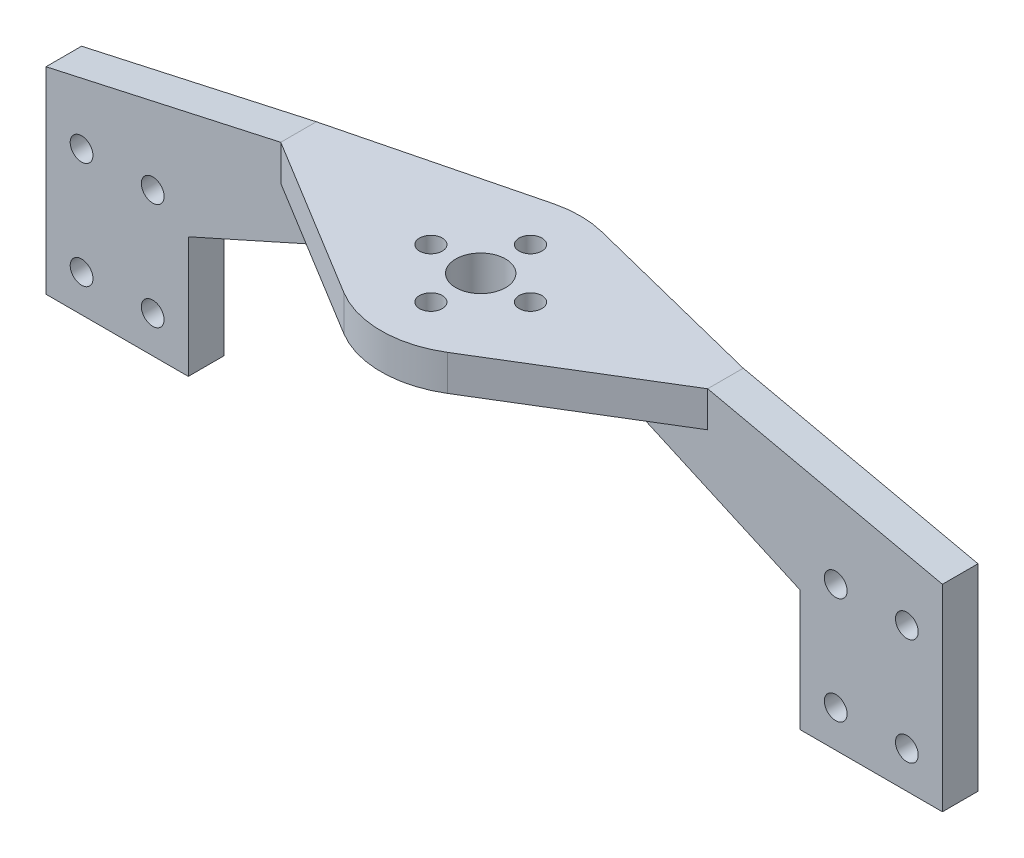
ISO-10303-21;
HEADER;
FILE_DESCRIPTION(('STEP AP214'),'2;1');
FILE_NAME('part.step','',(''),(''),'','','');
FILE_SCHEMA(('AUTOMOTIVE_DESIGN { 1 0 10303 214 1 1 1 1 }'));
ENDSEC;
DATA;
#1=APPLICATION_CONTEXT('core data for automotive mechanical design processes');
#2=APPLICATION_PROTOCOL_DEFINITION('international standard','automotive_design',2000,#1);
#3=PRODUCT_CONTEXT('',#1,'mechanical');
#4=PRODUCT('Part','Part','',(#3));
#5=PRODUCT_RELATED_PRODUCT_CATEGORY('part','',(#4));
#6=PRODUCT_DEFINITION_FORMATION('','',#4);
#7=PRODUCT_DEFINITION_CONTEXT('part definition',#1,'design');
#8=PRODUCT_DEFINITION('design','',#6,#7);
#9=PRODUCT_DEFINITION_SHAPE('','',#8);
#10=(LENGTH_UNIT() NAMED_UNIT(*) SI_UNIT(.MILLI.,.METRE.));
#11=(NAMED_UNIT(*) PLANE_ANGLE_UNIT() SI_UNIT($,.RADIAN.));
#12=(NAMED_UNIT(*) SI_UNIT($,.STERADIAN.) SOLID_ANGLE_UNIT());
#13=UNCERTAINTY_MEASURE_WITH_UNIT(LENGTH_MEASURE(1.E-05),#10,'distance_accuracy_value','');
#14=(GEOMETRIC_REPRESENTATION_CONTEXT(3) GLOBAL_UNCERTAINTY_ASSIGNED_CONTEXT((#13)) GLOBAL_UNIT_ASSIGNED_CONTEXT((#10,
#11,#12)) REPRESENTATION_CONTEXT('',''));
#15=CARTESIAN_POINT('',(0.,0.,0.));
#16=DIRECTION('',(0.,0.,1.));
#17=DIRECTION('',(1.,0.,0.));
#18=AXIS2_PLACEMENT_3D('',#15,#16,#17);
#19=CARTESIAN_POINT('',(0.,5.,-17.0232575033399));
#20=DIRECTION('',(0.,1.,0.));
#21=DIRECTION('',(0.,0.,1.));
#22=AXIS2_PLACEMENT_3D('',#19,#20,#21);
#23=PLANE('',#22);
#24=DIRECTION('',(0.,0.,-1.));
#25=VECTOR('',#24,1.);
#26=CARTESIAN_POINT('',(30.,5.,-3.02325750333987));
#27=LINE('',#26,#25);
#28=CARTESIAN_POINT('',(30.,5.,-18.9232575033399));
#29=VERTEX_POINT('',#28);
#30=CARTESIAN_POINT('',(30.,5.,-23.9232575033399));
#31=VERTEX_POINT('',#30);
#32=EDGE_CURVE('E175',#29,#31,#27,.T.);
#33=ORIENTED_EDGE('',*,*,#32,.T.);
#34=DIRECTION('',(-0.969877055784616,0.,-0.243594943836205));
#35=VECTOR('',#34,1.);
#36=CARTESIAN_POINT('',(30.,5.,-23.9232575033399));
#37=LINE('',#36,#35);
#38=CARTESIAN_POINT('',(3.41032921370687,5.,-30.6015362843245));
#39=VERTEX_POINT('',#38);
#40=EDGE_CURVE('E231',#31,#39,#37,.T.);
#41=ORIENTED_EDGE('',*,*,#40,.T.);
#42=CARTESIAN_POINT('',(0.,5.,-17.0232575033399));
#43=DIRECTION('',(0.,1.,0.));
#44=DIRECTION('',(0.,0.,1.));
#45=AXIS2_PLACEMENT_3D('',#42,#43,#44);
#46=CIRCLE('',#45,14.);
#47=CARTESIAN_POINT('',(-3.41032921370687,5.,-30.6015362843245));
#48=VERTEX_POINT('',#47);
#49=EDGE_CURVE('E234',#39,#48,#46,.T.);
#50=ORIENTED_EDGE('',*,*,#49,.T.);
#51=DIRECTION('',(-0.969877055784616,0.,0.243594943836205));
#52=VECTOR('',#51,1.);
#53=CARTESIAN_POINT('',(-30.,5.,-23.9232575033399));
#54=LINE('',#53,#52);
#55=CARTESIAN_POINT('',(-30.,5.,-23.9232575033399));
#56=VERTEX_POINT('',#55);
#57=EDGE_CURVE('E237',#48,#56,#54,.T.);
#58=ORIENTED_EDGE('',*,*,#57,.T.);
#59=DIRECTION('',(0.,0.,-1.));
#60=VECTOR('',#59,1.);
#61=CARTESIAN_POINT('',(-30.,5.,-3.02325750333987));
#62=LINE('',#61,#60);
#63=CARTESIAN_POINT('',(-30.,5.,-18.9232575033399));
#64=VERTEX_POINT('',#63);
#65=EDGE_CURVE('E432',#64,#56,#62,.T.);
#66=ORIENTED_EDGE('',*,*,#65,.F.);
#67=DIRECTION('',(0.853718080798827,0.,0.520735478450593));
#68=VECTOR('',#67,1.);
#69=CARTESIAN_POINT('',(-30.,5.,-18.9232575033399));
#70=LINE('',#69,#68);
#71=CARTESIAN_POINT('',(-7.29029669830831,5.,-5.07120437215629));
#72=VERTEX_POINT('',#71);
#73=EDGE_CURVE('E240',#64,#72,#70,.T.);
#74=ORIENTED_EDGE('',*,*,#73,.T.);
#75=CARTESIAN_POINT('',(0.,5.,-17.0232575033399));
#76=DIRECTION('',(0.,1.,0.));
#77=DIRECTION('',(0.,0.,1.));
#78=AXIS2_PLACEMENT_3D('',#75,#76,#77);
#79=CIRCLE('',#78,14.);
#80=CARTESIAN_POINT('',(7.29029669830831,5.,-5.07120437215629));
#81=VERTEX_POINT('',#80);
#82=EDGE_CURVE('E242',#72,#81,#79,.T.);
#83=ORIENTED_EDGE('',*,*,#82,.T.);
#84=DIRECTION('',(0.853718080798827,0.,-0.520735478450593));
#85=VECTOR('',#84,1.);
#86=CARTESIAN_POINT('',(30.,5.,-18.9232575033399));
#87=LINE('',#86,#85);
#88=EDGE_CURVE('E244',#81,#29,#87,.T.);
#89=ORIENTED_EDGE('',*,*,#88,.T.);
#90=EDGE_LOOP('',(#33,#41,#50,#58,#66,#74,#83,#89));
#91=FACE_BOUND('',#90,.T.);
#92=CARTESIAN_POINT('',(7.,5.,-17.0232575033399));
#93=DIRECTION('',(0.,1.,0.));
#94=DIRECTION('',(0.,0.,-1.));
#95=AXIS2_PLACEMENT_3D('',#92,#93,#94);
#96=CIRCLE('',#95,1.6);
#97=CARTESIAN_POINT('',(7.,5.,-18.6232575033399));
#98=VERTEX_POINT('',#97);
#99=EDGE_CURVE('E207',#98,#98,#96,.T.);
#100=ORIENTED_EDGE('',*,*,#99,.F.);
#101=EDGE_LOOP('',(#100));
#102=FACE_BOUND('',#101,.T.);
#103=CARTESIAN_POINT('',(0.,5.,-10.0232575033399));
#104=DIRECTION('',(0.,1.,0.));
#105=DIRECTION('',(0.,0.,1.));
#106=AXIS2_PLACEMENT_3D('',#103,#104,#105);
#107=CIRCLE('',#106,1.6);
#108=CARTESIAN_POINT('',(0.,5.,-8.42325750333988));
#109=VERTEX_POINT('',#108);
#110=EDGE_CURVE('E219',#109,#109,#107,.T.);
#111=ORIENTED_EDGE('',*,*,#110,.F.);
#112=EDGE_LOOP('',(#111));
#113=FACE_BOUND('',#112,.T.);
#114=CARTESIAN_POINT('',(0.,5.,-24.0232575033399));
#115=DIRECTION('',(0.,1.,0.));
#116=DIRECTION('',(0.,0.,1.));
#117=AXIS2_PLACEMENT_3D('',#114,#115,#116);
#118=CIRCLE('',#117,1.6);
#119=CARTESIAN_POINT('',(0.,5.,-22.4232575033399));
#120=VERTEX_POINT('',#119);
#121=EDGE_CURVE('E225',#120,#120,#118,.T.);
#122=ORIENTED_EDGE('',*,*,#121,.F.);
#123=EDGE_LOOP('',(#122));
#124=FACE_BOUND('',#123,.T.);
#125=CARTESIAN_POINT('',(-7.,5.,-17.0232575033399));
#126=DIRECTION('',(0.,1.,0.));
#127=DIRECTION('',(0.,0.,1.));
#128=AXIS2_PLACEMENT_3D('',#125,#126,#127);
#129=CIRCLE('',#128,1.6);
#130=CARTESIAN_POINT('',(-7.,5.,-15.4232575033399));
#131=VERTEX_POINT('',#130);
#132=EDGE_CURVE('E213',#131,#131,#129,.T.);
#133=ORIENTED_EDGE('',*,*,#132,.F.);
#134=EDGE_LOOP('',(#133));
#135=FACE_BOUND('',#134,.T.);
#136=CARTESIAN_POINT('',(0.,5.,-17.0232575033399));
#137=DIRECTION('',(0.,1.,0.));
#138=DIRECTION('',(0.,0.,1.));
#139=AXIS2_PLACEMENT_3D('',#136,#137,#138);
#140=CIRCLE('',#139,3.5);
#141=CARTESIAN_POINT('',(0.,5.,-13.5232575033399));
#142=VERTEX_POINT('',#141);
#143=EDGE_CURVE('E201',#142,#142,#140,.T.);
#144=ORIENTED_EDGE('',*,*,#143,.F.);
#145=EDGE_LOOP('',(#144));
#146=FACE_BOUND('',#145,.T.);
#147=ADVANCED_FACE('F37',(#91,#102,#113,#124,#135,#146),#23,.T.);
#148=CARTESIAN_POINT('',(0.,0.,-17.0232575033399));
#149=DIRECTION('',(0.,1.,0.));
#150=DIRECTION('',(0.,0.,1.));
#151=AXIS2_PLACEMENT_3D('',#148,#149,#150);
#152=PLANE('',#151);
#153=DIRECTION('',(0.,0.,-1.));
#154=VECTOR('',#153,1.);
#155=CARTESIAN_POINT('',(14.,0.,-18.9232575033399));
#156=LINE('',#155,#154);
#157=CARTESIAN_POINT('',(14.,0.,-18.9232575033399));
#158=VERTEX_POINT('',#157);
#159=CARTESIAN_POINT('',(14.,0.,-23.9232575033399));
#160=VERTEX_POINT('',#159);
#161=EDGE_CURVE('E381',#158,#160,#156,.T.);
#162=ORIENTED_EDGE('',*,*,#161,.F.);
#163=DIRECTION('',(1.,0.,0.));
#164=VECTOR('',#163,1.);
#165=CARTESIAN_POINT('',(43.,0.,-18.9232575033399));
#166=LINE('',#165,#164);
#167=CARTESIAN_POINT('',(30.,0.,-18.9232575033399));
#168=VERTEX_POINT('',#167);
#169=EDGE_CURVE('E374',#158,#168,#166,.T.);
#170=ORIENTED_EDGE('',*,*,#169,.T.);
#171=DIRECTION('',(0.853718080798827,0.,-0.520735478450593));
#172=VECTOR('',#171,1.);
#173=CARTESIAN_POINT('',(30.,0.,-18.9232575033399));
#174=LINE('',#173,#172);
#175=CARTESIAN_POINT('',(7.29029669830831,0.,-5.07120437215629));
#176=VERTEX_POINT('',#175);
#177=EDGE_CURVE('E235',#176,#168,#174,.T.);
#178=ORIENTED_EDGE('',*,*,#177,.F.);
#179=CARTESIAN_POINT('',(0.,0.,-17.0232575033399));
#180=DIRECTION('',(0.,1.,0.));
#181=DIRECTION('',(0.,0.,1.));
#182=AXIS2_PLACEMENT_3D('',#179,#180,#181);
#183=CIRCLE('',#182,14.);
#184=CARTESIAN_POINT('',(-7.29029669830831,0.,-5.07120437215629));
#185=VERTEX_POINT('',#184);
#186=EDGE_CURVE('E256',#185,#176,#183,.T.);
#187=ORIENTED_EDGE('',*,*,#186,.F.);
#188=DIRECTION('',(0.853718080798827,0.,0.520735478450593));
#189=VECTOR('',#188,1.);
#190=CARTESIAN_POINT('',(-30.,0.,-18.9232575033399));
#191=LINE('',#190,#189);
#192=CARTESIAN_POINT('',(-30.,0.,-18.9232575033399));
#193=VERTEX_POINT('',#192);
#194=EDGE_CURVE('E254',#193,#185,#191,.T.);
#195=ORIENTED_EDGE('',*,*,#194,.F.);
#196=DIRECTION('',(1.,0.,0.));
#197=VECTOR('',#196,1.);
#198=CARTESIAN_POINT('',(-43.,0.,-18.9232575033399));
#199=LINE('',#198,#197);
#200=CARTESIAN_POINT('',(-14.,0.,-18.9232575033399));
#201=VERTEX_POINT('',#200);
#202=EDGE_CURVE('E385',#193,#201,#199,.T.);
#203=ORIENTED_EDGE('',*,*,#202,.T.);
#204=DIRECTION('',(0.,0.,-1.));
#205=VECTOR('',#204,1.);
#206=CARTESIAN_POINT('',(-14.,0.,-18.9232575033399));
#207=LINE('',#206,#205);
#208=CARTESIAN_POINT('',(-14.,0.,-23.9232575033399));
#209=VERTEX_POINT('',#208);
#210=EDGE_CURVE('E391',#201,#209,#207,.T.);
#211=ORIENTED_EDGE('',*,*,#210,.T.);
#212=DIRECTION('',(1.,0.,0.));
#213=VECTOR('',#212,1.);
#214=CARTESIAN_POINT('',(-43.,0.,-23.9232575033399));
#215=LINE('',#214,#213);
#216=CARTESIAN_POINT('',(-30.,0.,-23.9232575033399));
#217=VERTEX_POINT('',#216);
#218=EDGE_CURVE('E392',#217,#209,#215,.T.);
#219=ORIENTED_EDGE('',*,*,#218,.F.);
#220=DIRECTION('',(-0.969877055784616,0.,0.243594943836205));
#221=VECTOR('',#220,1.);
#222=CARTESIAN_POINT('',(-30.,0.,-23.9232575033399));
#223=LINE('',#222,#221);
#224=CARTESIAN_POINT('',(-3.41032921370687,0.,-30.6015362843245));
#225=VERTEX_POINT('',#224);
#226=EDGE_CURVE('E251',#225,#217,#223,.T.);
#227=ORIENTED_EDGE('',*,*,#226,.F.);
#228=CARTESIAN_POINT('',(0.,0.,-17.0232575033399));
#229=DIRECTION('',(0.,1.,0.));
#230=DIRECTION('',(0.,0.,1.));
#231=AXIS2_PLACEMENT_3D('',#228,#229,#230);
#232=CIRCLE('',#231,14.);
#233=CARTESIAN_POINT('',(3.41032921370687,0.,-30.6015362843245));
#234=VERTEX_POINT('',#233);
#235=EDGE_CURVE('E249',#234,#225,#232,.T.);
#236=ORIENTED_EDGE('',*,*,#235,.F.);
#237=DIRECTION('',(-0.969877055784616,0.,-0.243594943836205));
#238=VECTOR('',#237,1.);
#239=CARTESIAN_POINT('',(30.,0.,-23.9232575033399));
#240=LINE('',#239,#238);
#241=CARTESIAN_POINT('',(30.,0.,-23.9232575033399));
#242=VERTEX_POINT('',#241);
#243=EDGE_CURVE('E228',#242,#234,#240,.T.);
#244=ORIENTED_EDGE('',*,*,#243,.F.);
#245=DIRECTION('',(1.,0.,0.));
#246=VECTOR('',#245,1.);
#247=CARTESIAN_POINT('',(43.,0.,-23.9232575033399));
#248=LINE('',#247,#246);
#249=EDGE_CURVE('E377',#160,#242,#248,.T.);
#250=ORIENTED_EDGE('',*,*,#249,.F.);
#251=EDGE_LOOP('',(#162,#170,#178,#187,#195,#203,#211,#219,#227,#236,#244,#250));
#252=FACE_BOUND('',#251,.T.);
#253=CARTESIAN_POINT('',(0.,0.,-24.0232575033399));
#254=DIRECTION('',(0.,1.,0.));
#255=DIRECTION('',(0.,0.,1.));
#256=AXIS2_PLACEMENT_3D('',#253,#254,#255);
#257=CIRCLE('',#256,1.6);
#258=CARTESIAN_POINT('',(0.,0.,-22.4232575033399));
#259=VERTEX_POINT('',#258);
#260=EDGE_CURVE('E222',#259,#259,#257,.T.);
#261=ORIENTED_EDGE('',*,*,#260,.T.);
#262=EDGE_LOOP('',(#261));
#263=FACE_BOUND('',#262,.T.);
#264=CARTESIAN_POINT('',(0.,0.,-10.0232575033399));
#265=DIRECTION('',(0.,1.,0.));
#266=DIRECTION('',(0.,0.,1.));
#267=AXIS2_PLACEMENT_3D('',#264,#265,#266);
#268=CIRCLE('',#267,1.6);
#269=CARTESIAN_POINT('',(0.,0.,-8.42325750333988));
#270=VERTEX_POINT('',#269);
#271=EDGE_CURVE('E216',#270,#270,#268,.T.);
#272=ORIENTED_EDGE('',*,*,#271,.T.);
#273=EDGE_LOOP('',(#272));
#274=FACE_BOUND('',#273,.T.);
#275=CARTESIAN_POINT('',(-7.,0.,-17.0232575033399));
#276=DIRECTION('',(0.,1.,0.));
#277=DIRECTION('',(0.,0.,1.));
#278=AXIS2_PLACEMENT_3D('',#275,#276,#277);
#279=CIRCLE('',#278,1.6);
#280=CARTESIAN_POINT('',(-7.,0.,-15.4232575033399));
#281=VERTEX_POINT('',#280);
#282=EDGE_CURVE('E210',#281,#281,#279,.T.);
#283=ORIENTED_EDGE('',*,*,#282,.T.);
#284=EDGE_LOOP('',(#283));
#285=FACE_BOUND('',#284,.T.);
#286=CARTESIAN_POINT('',(7.,0.,-17.0232575033399));
#287=DIRECTION('',(0.,1.,0.));
#288=DIRECTION('',(0.,0.,-1.));
#289=AXIS2_PLACEMENT_3D('',#286,#287,#288);
#290=CIRCLE('',#289,1.6);
#291=CARTESIAN_POINT('',(7.,0.,-18.6232575033399));
#292=VERTEX_POINT('',#291);
#293=EDGE_CURVE('E204',#292,#292,#290,.T.);
#294=ORIENTED_EDGE('',*,*,#293,.T.);
#295=EDGE_LOOP('',(#294));
#296=FACE_BOUND('',#295,.T.);
#297=CARTESIAN_POINT('',(0.,0.,-17.0232575033399));
#298=DIRECTION('',(0.,1.,0.));
#299=DIRECTION('',(0.,0.,1.));
#300=AXIS2_PLACEMENT_3D('',#297,#298,#299);
#301=CIRCLE('',#300,3.5);
#302=CARTESIAN_POINT('',(0.,0.,-13.5232575033399));
#303=VERTEX_POINT('',#302);
#304=EDGE_CURVE('E199',#303,#303,#301,.T.);
#305=ORIENTED_EDGE('',*,*,#304,.T.);
#306=EDGE_LOOP('',(#305));
#307=FACE_BOUND('',#306,.T.);
#308=ADVANCED_FACE('F420',(#252,#263,#274,#285,#296,#307),#152,.F.);
#309=CARTESIAN_POINT('',(30.,5.,-23.9232575033399));
#310=DIRECTION('',(-0.243594943836205,0.,0.969877055784617));
#311=DIRECTION('',(0.969877055784617,0.,0.243594943836205));
#312=AXIS2_PLACEMENT_3D('',#309,#310,#311);
#313=PLANE('',#312);
#314=ORIENTED_EDGE('',*,*,#243,.T.);
#315=DIRECTION('',(0.,-1.,0.));
#316=VECTOR('',#315,1.);
#317=CARTESIAN_POINT('',(3.41032921370687,5.,-30.6015362843245));
#318=LINE('',#317,#316);
#319=EDGE_CURVE('E279',#39,#234,#318,.T.);
#320=ORIENTED_EDGE('',*,*,#319,.F.);
#321=ORIENTED_EDGE('',*,*,#40,.F.);
#322=DIRECTION('',(0.,-1.,0.));
#323=VECTOR('',#322,1.);
#324=CARTESIAN_POINT('',(30.,5.,-23.9232575033399));
#325=LINE('',#324,#323);
#326=EDGE_CURVE('E173',#31,#242,#325,.T.);
#327=ORIENTED_EDGE('',*,*,#326,.T.);
#328=EDGE_LOOP('',(#314,#320,#321,#327));
#329=FACE_BOUND('',#328,.T.);
#330=ADVANCED_FACE('F39',(#329),#313,.F.);
#331=CARTESIAN_POINT('',(0.,5.,-17.0232575033399));
#332=DIRECTION('',(0.,-1.,0.));
#333=DIRECTION('',(0.,0.,-1.));
#334=AXIS2_PLACEMENT_3D('',#331,#332,#333);
#335=CYLINDRICAL_SURFACE('',#334,14.);
#336=ORIENTED_EDGE('',*,*,#235,.T.);
#337=DIRECTION('',(0.,-1.,0.));
#338=VECTOR('',#337,1.);
#339=CARTESIAN_POINT('',(-3.41032921370687,5.,-30.6015362843245));
#340=LINE('',#339,#338);
#341=EDGE_CURVE('E276',#48,#225,#340,.T.);
#342=ORIENTED_EDGE('',*,*,#341,.F.);
#343=ORIENTED_EDGE('',*,*,#49,.F.);
#344=ORIENTED_EDGE('',*,*,#319,.T.);
#345=EDGE_LOOP('',(#336,#342,#343,#344));
#346=FACE_BOUND('',#345,.T.);
#347=ADVANCED_FACE('F490',(#346),#335,.T.);
#348=CARTESIAN_POINT('',(-30.,5.,-23.9232575033399));
#349=DIRECTION('',(0.243594943836205,0.,0.969877055784617));
#350=DIRECTION('',(0.969877055784617,0.,-0.243594943836205));
#351=AXIS2_PLACEMENT_3D('',#348,#349,#350);
#352=PLANE('',#351);
#353=ORIENTED_EDGE('',*,*,#226,.T.);
#354=DIRECTION('',(0.,-1.,0.));
#355=VECTOR('',#354,1.);
#356=CARTESIAN_POINT('',(-30.,5.,-23.9232575033399));
#357=LINE('',#356,#355);
#358=EDGE_CURVE('E273',#56,#217,#357,.T.);
#359=ORIENTED_EDGE('',*,*,#358,.F.);
#360=ORIENTED_EDGE('',*,*,#57,.F.);
#361=ORIENTED_EDGE('',*,*,#341,.T.);
#362=EDGE_LOOP('',(#353,#359,#360,#361));
#363=FACE_BOUND('',#362,.T.);
#364=ADVANCED_FACE('F488',(#363),#352,.F.);
#365=CARTESIAN_POINT('',(-45.,5.,-23.9232575033399));
#366=DIRECTION('',(0.,0.,1.));
#367=DIRECTION('',(1.,0.,0.));
#368=AXIS2_PLACEMENT_3D('',#365,#366,#367);
#369=PLANE('',#368);
#370=DIRECTION('',(0.,1.,0.));
#371=VECTOR('',#370,1.);
#372=CARTESIAN_POINT('',(-63.,5.00000000000001,-23.9232575033399));
#373=LINE('',#372,#371);
#374=CARTESIAN_POINT('',(-63.,-30.,-23.9232575033399));
#375=VERTEX_POINT('',#374);
#376=CARTESIAN_POINT('',(-63.,-2.29999999999987,-23.9232575033399));
#377=VERTEX_POINT('',#376);
#378=EDGE_CURVE('E401',#375,#377,#373,.T.);
#379=ORIENTED_EDGE('',*,*,#378,.T.);
#380=DIRECTION('',(-0.976395462399394,-0.215990511379256,0.));
#381=VECTOR('',#380,1.);
#382=CARTESIAN_POINT('',(-63.,-2.29999999999987,-23.9232575033399));
#383=LINE('',#382,#381);
#384=EDGE_CURVE('E59',#56,#377,#383,.T.);
#385=ORIENTED_EDGE('',*,*,#384,.F.);
#386=ORIENTED_EDGE('',*,*,#358,.T.);
#387=ORIENTED_EDGE('',*,*,#218,.T.);
#388=DIRECTION('',(-0.912509324514951,-0.409055904092909,0.));
#389=VECTOR('',#388,1.);
#390=CARTESIAN_POINT('',(-14.,0.,-23.9232575033399));
#391=LINE('',#390,#389);
#392=CARTESIAN_POINT('',(-43.,-13.,-23.9232575033399));
#393=VERTEX_POINT('',#392);
#394=EDGE_CURVE('E389',#209,#393,#391,.T.);
#395=ORIENTED_EDGE('',*,*,#394,.T.);
#396=DIRECTION('',(0.,-1.,0.));
#397=VECTOR('',#396,1.);
#398=CARTESIAN_POINT('',(-43.,-7.63227786984491,-23.9232575033399));
#399=LINE('',#398,#397);
#400=CARTESIAN_POINT('',(-43.,-30.,-23.9232575033399));
#401=VERTEX_POINT('',#400);
#402=EDGE_CURVE('E313',#393,#401,#399,.T.);
#403=ORIENTED_EDGE('',*,*,#402,.T.);
#404=DIRECTION('',(-1.,0.,0.));
#405=VECTOR('',#404,1.);
#406=CARTESIAN_POINT('',(-63.,-30.,-23.9232575033399));
#407=LINE('',#406,#405);
#408=EDGE_CURVE('E309',#401,#375,#407,.T.);
#409=ORIENTED_EDGE('',*,*,#408,.T.);
#410=EDGE_LOOP('',(#379,#385,#386,#387,#395,#403,#409));
#411=FACE_BOUND('',#410,.T.);
#412=CARTESIAN_POINT('',(-58.,-9.79999999999999,-23.9232575033399));
#413=DIRECTION('',(0.,0.,-1.));
#414=DIRECTION('',(1.,0.,0.));
#415=AXIS2_PLACEMENT_3D('',#412,#413,#414);
#416=CIRCLE('',#415,1.6);
#417=CARTESIAN_POINT('',(-56.4,-9.79999999999999,-23.9232575033399));
#418=VERTEX_POINT('',#417);
#419=EDGE_CURVE('E333',#418,#418,#416,.T.);
#420=ORIENTED_EDGE('',*,*,#419,.F.);
#421=EDGE_LOOP('',(#420));
#422=FACE_BOUND('',#421,.T.);
#423=CARTESIAN_POINT('',(-58.,-24.8,-23.9232575033399));
#424=DIRECTION('',(0.,0.,-1.));
#425=DIRECTION('',(1.,0.,0.));
#426=AXIS2_PLACEMENT_3D('',#423,#424,#425);
#427=CIRCLE('',#426,1.6);
#428=CARTESIAN_POINT('',(-56.4,-24.8,-23.9232575033399));
#429=VERTEX_POINT('',#428);
#430=EDGE_CURVE('E327',#429,#429,#427,.T.);
#431=ORIENTED_EDGE('',*,*,#430,.F.);
#432=EDGE_LOOP('',(#431));
#433=FACE_BOUND('',#432,.T.);
#434=CARTESIAN_POINT('',(-48.,-24.8,-23.9232575033399));
#435=DIRECTION('',(0.,0.,-1.));
#436=DIRECTION('',(-1.,0.,0.));
#437=AXIS2_PLACEMENT_3D('',#434,#435,#436);
#438=CIRCLE('',#437,1.6);
#439=CARTESIAN_POINT('',(-49.6,-24.8,-23.9232575033399));
#440=VERTEX_POINT('',#439);
#441=EDGE_CURVE('E321',#440,#440,#438,.T.);
#442=ORIENTED_EDGE('',*,*,#441,.F.);
#443=EDGE_LOOP('',(#442));
#444=FACE_BOUND('',#443,.T.);
#445=CARTESIAN_POINT('',(-48.,-9.79999999999999,-23.9232575033399));
#446=DIRECTION('',(0.,0.,-1.));
#447=DIRECTION('',(-1.,0.,0.));
#448=AXIS2_PLACEMENT_3D('',#445,#446,#447);
#449=CIRCLE('',#448,1.6);
#450=CARTESIAN_POINT('',(-49.6,-9.79999999999999,-23.9232575033399));
#451=VERTEX_POINT('',#450);
#452=EDGE_CURVE('E314',#451,#451,#449,.T.);
#453=ORIENTED_EDGE('',*,*,#452,.F.);
#454=EDGE_LOOP('',(#453));
#455=FACE_BOUND('',#454,.T.);
#456=ADVANCED_FACE('F405',(#411,#422,#433,#444,#455),#369,.F.);
#457=CARTESIAN_POINT('',(-30.,5.,-18.9232575033399));
#458=DIRECTION('',(0.,0.,-1.));
#459=DIRECTION('',(-1.,0.,0.));
#460=AXIS2_PLACEMENT_3D('',#457,#458,#459);
#461=PLANE('',#460);
#462=DIRECTION('',(0.,-1.,0.));
#463=VECTOR('',#462,1.);
#464=CARTESIAN_POINT('',(-30.,5.,-18.9232575033399));
#465=LINE('',#464,#463);
#466=EDGE_CURVE('E270',#64,#193,#465,.T.);
#467=ORIENTED_EDGE('',*,*,#466,.F.);
#468=DIRECTION('',(-0.976395462399395,-0.215990511379256,0.));
#469=VECTOR('',#468,1.);
#470=CARTESIAN_POINT('',(-30.,5.,-18.9232575033399));
#471=LINE('',#470,#469);
#472=CARTESIAN_POINT('',(-63.,-2.29999999999987,-18.9232575033399));
#473=VERTEX_POINT('',#472);
#474=EDGE_CURVE('E283',#64,#473,#471,.T.);
#475=ORIENTED_EDGE('',*,*,#474,.T.);
#476=DIRECTION('',(0.,1.,0.));
#477=VECTOR('',#476,1.);
#478=CARTESIAN_POINT('',(-63.,5.00000000000001,-18.9232575033399));
#479=LINE('',#478,#477);
#480=CARTESIAN_POINT('',(-63.,-30.,-18.9232575033399));
#481=VERTEX_POINT('',#480);
#482=EDGE_CURVE('E295',#481,#473,#479,.T.);
#483=ORIENTED_EDGE('',*,*,#482,.F.);
#484=DIRECTION('',(-1.,0.,0.));
#485=VECTOR('',#484,1.);
#486=CARTESIAN_POINT('',(-63.,-30.,-18.9232575033399));
#487=LINE('',#486,#485);
#488=CARTESIAN_POINT('',(-43.,-30.,-18.9232575033399));
#489=VERTEX_POINT('',#488);
#490=EDGE_CURVE('E301',#489,#481,#487,.T.);
#491=ORIENTED_EDGE('',*,*,#490,.F.);
#492=DIRECTION('',(0.,-1.,0.));
#493=VECTOR('',#492,1.);
#494=CARTESIAN_POINT('',(-43.,-7.63227786984491,-18.9232575033399));
#495=LINE('',#494,#493);
#496=CARTESIAN_POINT('',(-43.,-13.,-18.9232575033399));
#497=VERTEX_POINT('',#496);
#498=EDGE_CURVE('E304',#497,#489,#495,.T.);
#499=ORIENTED_EDGE('',*,*,#498,.F.);
#500=DIRECTION('',(-0.912509324514951,-0.409055904092909,0.));
#501=VECTOR('',#500,1.);
#502=CARTESIAN_POINT('',(-14.,0.,-18.9232575033399));
#503=LINE('',#502,#501);
#504=EDGE_CURVE('E388',#201,#497,#503,.T.);
#505=ORIENTED_EDGE('',*,*,#504,.F.);
#506=ORIENTED_EDGE('',*,*,#202,.F.);
#507=EDGE_LOOP('',(#467,#475,#483,#491,#499,#505,#506));
#508=FACE_BOUND('',#507,.T.);
#509=CARTESIAN_POINT('',(-48.,-9.79999999999999,-18.9232575033399));
#510=DIRECTION('',(0.,0.,-1.));
#511=DIRECTION('',(-1.,0.,0.));
#512=AXIS2_PLACEMENT_3D('',#509,#510,#511);
#513=CIRCLE('',#512,1.6);
#514=CARTESIAN_POINT('',(-49.6,-9.79999999999999,-18.9232575033399));
#515=VERTEX_POINT('',#514);
#516=EDGE_CURVE('E318',#515,#515,#513,.T.);
#517=ORIENTED_EDGE('',*,*,#516,.T.);
#518=EDGE_LOOP('',(#517));
#519=FACE_BOUND('',#518,.T.);
#520=CARTESIAN_POINT('',(-48.,-24.8,-18.9232575033399));
#521=DIRECTION('',(0.,0.,-1.));
#522=DIRECTION('',(-1.,0.,0.));
#523=AXIS2_PLACEMENT_3D('',#520,#521,#522);
#524=CIRCLE('',#523,1.6);
#525=CARTESIAN_POINT('',(-49.6,-24.8,-18.9232575033399));
#526=VERTEX_POINT('',#525);
#527=EDGE_CURVE('E317',#526,#526,#524,.T.);
#528=ORIENTED_EDGE('',*,*,#527,.T.);
#529=EDGE_LOOP('',(#528));
#530=FACE_BOUND('',#529,.T.);
#531=CARTESIAN_POINT('',(-58.,-24.8,-18.9232575033399));
#532=DIRECTION('',(0.,0.,-1.));
#533=DIRECTION('',(1.,0.,0.));
#534=AXIS2_PLACEMENT_3D('',#531,#532,#533);
#535=CIRCLE('',#534,1.6);
#536=CARTESIAN_POINT('',(-56.4,-24.8,-18.9232575033399));
#537=VERTEX_POINT('',#536);
#538=EDGE_CURVE('E324',#537,#537,#535,.T.);
#539=ORIENTED_EDGE('',*,*,#538,.T.);
#540=EDGE_LOOP('',(#539));
#541=FACE_BOUND('',#540,.T.);
#542=CARTESIAN_POINT('',(-58.,-9.79999999999999,-18.9232575033399));
#543=DIRECTION('',(0.,0.,-1.));
#544=DIRECTION('',(1.,0.,0.));
#545=AXIS2_PLACEMENT_3D('',#542,#543,#544);
#546=CIRCLE('',#545,1.6);
#547=CARTESIAN_POINT('',(-56.4,-9.79999999999999,-18.9232575033399));
#548=VERTEX_POINT('',#547);
#549=EDGE_CURVE('E330',#548,#548,#546,.T.);
#550=ORIENTED_EDGE('',*,*,#549,.T.);
#551=EDGE_LOOP('',(#550));
#552=FACE_BOUND('',#551,.T.);
#553=ADVANCED_FACE('F292',(#508,#519,#530,#541,#552),#461,.F.);
#554=CARTESIAN_POINT('',(-30.,5.,-18.9232575033399));
#555=DIRECTION('',(0.520735478450593,0.,-0.853718080798827));
#556=DIRECTION('',(-0.853718080798827,0.,-0.520735478450593));
#557=AXIS2_PLACEMENT_3D('',#554,#555,#556);
#558=PLANE('',#557);
#559=ORIENTED_EDGE('',*,*,#194,.T.);
#560=DIRECTION('',(0.,-1.,0.));
#561=VECTOR('',#560,1.);
#562=CARTESIAN_POINT('',(-7.29029669830831,5.,-5.07120437215629));
#563=LINE('',#562,#561);
#564=EDGE_CURVE('E267',#72,#185,#563,.T.);
#565=ORIENTED_EDGE('',*,*,#564,.F.);
#566=ORIENTED_EDGE('',*,*,#73,.F.);
#567=ORIENTED_EDGE('',*,*,#466,.T.);
#568=EDGE_LOOP('',(#559,#565,#566,#567));
#569=FACE_BOUND('',#568,.T.);
#570=ADVANCED_FACE('F426',(#569),#558,.F.);
#571=CARTESIAN_POINT('',(0.,5.,-17.0232575033399));
#572=DIRECTION('',(0.,-1.,0.));
#573=DIRECTION('',(0.,0.,-1.));
#574=AXIS2_PLACEMENT_3D('',#571,#572,#573);
#575=CYLINDRICAL_SURFACE('',#574,14.);
#576=ORIENTED_EDGE('',*,*,#186,.T.);
#577=DIRECTION('',(0.,-1.,0.));
#578=VECTOR('',#577,1.);
#579=CARTESIAN_POINT('',(7.29029669830831,5.,-5.07120437215629));
#580=LINE('',#579,#578);
#581=EDGE_CURVE('E264',#81,#176,#580,.T.);
#582=ORIENTED_EDGE('',*,*,#581,.F.);
#583=ORIENTED_EDGE('',*,*,#82,.F.);
#584=ORIENTED_EDGE('',*,*,#564,.T.);
#585=EDGE_LOOP('',(#576,#582,#583,#584));
#586=FACE_BOUND('',#585,.T.);
#587=ADVANCED_FACE('F477',(#586),#575,.T.);
#588=CARTESIAN_POINT('',(30.,5.,-18.9232575033399));
#589=DIRECTION('',(-0.520735478450593,0.,-0.853718080798827));
#590=DIRECTION('',(-0.853718080798827,0.,0.520735478450593));
#591=AXIS2_PLACEMENT_3D('',#588,#589,#590);
#592=PLANE('',#591);
#593=ORIENTED_EDGE('',*,*,#177,.T.);
#594=DIRECTION('',(0.,-1.,0.));
#595=VECTOR('',#594,1.);
#596=CARTESIAN_POINT('',(30.,5.,-18.9232575033399));
#597=LINE('',#596,#595);
#598=EDGE_CURVE('E261',#29,#168,#597,.T.);
#599=ORIENTED_EDGE('',*,*,#598,.F.);
#600=ORIENTED_EDGE('',*,*,#88,.F.);
#601=ORIENTED_EDGE('',*,*,#581,.T.);
#602=EDGE_LOOP('',(#593,#599,#600,#601));
#603=FACE_BOUND('',#602,.T.);
#604=ADVANCED_FACE('F474',(#603),#592,.F.);
#605=CARTESIAN_POINT('',(30.,5.,-18.9232575033399));
#606=DIRECTION('',(0.,0.,-1.));
#607=DIRECTION('',(-1.,0.,0.));
#608=AXIS2_PLACEMENT_3D('',#605,#606,#607);
#609=PLANE('',#608);
#610=DIRECTION('',(0.,-1.,0.));
#611=VECTOR('',#610,1.);
#612=CARTESIAN_POINT('',(63.,5.,-18.9232575033399));
#613=LINE('',#612,#611);
#614=CARTESIAN_POINT('',(63.,-2.30000000000041,-18.9232575033399));
#615=VERTEX_POINT('',#614);
#616=CARTESIAN_POINT('',(63.,-30.,-18.9232575033399));
#617=VERTEX_POINT('',#616);
#618=EDGE_CURVE('E195',#615,#617,#613,.T.);
#619=ORIENTED_EDGE('',*,*,#618,.F.);
#620=DIRECTION('',(-0.976395462399391,0.215990511379272,0.));
#621=VECTOR('',#620,1.);
#622=CARTESIAN_POINT('',(30.,5.,-18.9232575033399));
#623=LINE('',#622,#621);
#624=EDGE_CURVE('E51',#615,#29,#623,.T.);
#625=ORIENTED_EDGE('',*,*,#624,.T.);
#626=ORIENTED_EDGE('',*,*,#598,.T.);
#627=ORIENTED_EDGE('',*,*,#169,.F.);
#628=DIRECTION('',(-0.912509324514951,0.409055904092909,0.));
#629=VECTOR('',#628,1.);
#630=CARTESIAN_POINT('',(43.,-13.,-18.9232575033399));
#631=LINE('',#630,#629);
#632=CARTESIAN_POINT('',(43.,-13.,-18.9232575033399));
#633=VERTEX_POINT('',#632);
#634=EDGE_CURVE('E373',#633,#158,#631,.T.);
#635=ORIENTED_EDGE('',*,*,#634,.F.);
#636=DIRECTION('',(0.,1.,0.));
#637=VECTOR('',#636,1.);
#638=CARTESIAN_POINT('',(43.,-20.4466945502565,-18.9232575033399));
#639=LINE('',#638,#637);
#640=CARTESIAN_POINT('',(43.,-30.,-18.9232575033399));
#641=VERTEX_POINT('',#640);
#642=EDGE_CURVE('E190',#641,#633,#639,.T.);
#643=ORIENTED_EDGE('',*,*,#642,.F.);
#644=DIRECTION('',(-1.,0.,0.));
#645=VECTOR('',#644,1.);
#646=CARTESIAN_POINT('',(63.,-30.,-18.9232575033399));
#647=LINE('',#646,#645);
#648=EDGE_CURVE('E358',#617,#641,#647,.T.);
#649=ORIENTED_EDGE('',*,*,#648,.F.);
#650=EDGE_LOOP('',(#619,#625,#626,#627,#635,#643,#649));
#651=FACE_BOUND('',#650,.T.);
#652=CARTESIAN_POINT('',(48.,-9.8,-18.9232575033399));
#653=DIRECTION('',(0.,0.,-1.));
#654=DIRECTION('',(1.,0.,0.));
#655=AXIS2_PLACEMENT_3D('',#652,#653,#654);
#656=CIRCLE('',#655,1.6);
#657=CARTESIAN_POINT('',(49.6,-9.8,-18.9232575033399));
#658=VERTEX_POINT('',#657);
#659=EDGE_CURVE('E339',#658,#658,#656,.T.);
#660=ORIENTED_EDGE('',*,*,#659,.T.);
#661=EDGE_LOOP('',(#660));
#662=FACE_BOUND('',#661,.T.);
#663=CARTESIAN_POINT('',(48.,-24.8,-18.9232575033399));
#664=DIRECTION('',(0.,0.,-1.));
#665=DIRECTION('',(1.,0.,0.));
#666=AXIS2_PLACEMENT_3D('',#663,#664,#665);
#667=CIRCLE('',#666,1.6);
#668=CARTESIAN_POINT('',(49.6,-24.8,-18.9232575033399));
#669=VERTEX_POINT('',#668);
#670=EDGE_CURVE('E345',#669,#669,#667,.T.);
#671=ORIENTED_EDGE('',*,*,#670,.T.);
#672=EDGE_LOOP('',(#671));
#673=FACE_BOUND('',#672,.T.);
#674=CARTESIAN_POINT('',(58.,-24.8,-18.9232575033399));
#675=DIRECTION('',(0.,0.,-1.));
#676=DIRECTION('',(-1.,0.,0.));
#677=AXIS2_PLACEMENT_3D('',#674,#675,#676);
#678=CIRCLE('',#677,1.6);
#679=CARTESIAN_POINT('',(56.4,-24.8,-18.9232575033399));
#680=VERTEX_POINT('',#679);
#681=EDGE_CURVE('E351',#680,#680,#678,.T.);
#682=ORIENTED_EDGE('',*,*,#681,.T.);
#683=EDGE_LOOP('',(#682));
#684=FACE_BOUND('',#683,.T.);
#685=CARTESIAN_POINT('',(58.,-9.8,-18.9232575033399));
#686=DIRECTION('',(0.,0.,-1.));
#687=DIRECTION('',(-1.,0.,0.));
#688=AXIS2_PLACEMENT_3D('',#685,#686,#687);
#689=CIRCLE('',#688,1.6);
#690=CARTESIAN_POINT('',(56.4,-9.8,-18.9232575033399));
#691=VERTEX_POINT('',#690);
#692=EDGE_CURVE('E182',#691,#691,#689,.T.);
#693=ORIENTED_EDGE('',*,*,#692,.T.);
#694=EDGE_LOOP('',(#693));
#695=FACE_BOUND('',#694,.T.);
#696=ADVANCED_FACE('F370',(#651,#662,#673,#684,#695),#609,.F.);
#697=CARTESIAN_POINT('',(30.,5.,-23.9232575033399));
#698=DIRECTION('',(0.,0.,1.));
#699=DIRECTION('',(1.,0.,0.));
#700=AXIS2_PLACEMENT_3D('',#697,#698,#699);
#701=PLANE('',#700);
#702=ORIENTED_EDGE('',*,*,#326,.F.);
#703=DIRECTION('',(-0.976395462399391,0.215990511379272,0.));
#704=VECTOR('',#703,1.);
#705=CARTESIAN_POINT('',(63.,-2.30000000000041,-23.9232575033399));
#706=LINE('',#705,#704);
#707=CARTESIAN_POINT('',(63.,-2.30000000000041,-23.9232575033399));
#708=VERTEX_POINT('',#707);
#709=EDGE_CURVE('E160',#708,#31,#706,.T.);
#710=ORIENTED_EDGE('',*,*,#709,.F.);
#711=DIRECTION('',(0.,-1.,0.));
#712=VECTOR('',#711,1.);
#713=CARTESIAN_POINT('',(63.,5.,-23.9232575033399));
#714=LINE('',#713,#712);
#715=CARTESIAN_POINT('',(63.,-30.,-23.9232575033399));
#716=VERTEX_POINT('',#715);
#717=EDGE_CURVE('E170',#708,#716,#714,.T.);
#718=ORIENTED_EDGE('',*,*,#717,.T.);
#719=DIRECTION('',(-1.,0.,0.));
#720=VECTOR('',#719,1.);
#721=CARTESIAN_POINT('',(63.,-30.,-23.9232575033399));
#722=LINE('',#721,#720);
#723=CARTESIAN_POINT('',(43.,-30.,-23.9232575033399));
#724=VERTEX_POINT('',#723);
#725=EDGE_CURVE('E181',#716,#724,#722,.T.);
#726=ORIENTED_EDGE('',*,*,#725,.T.);
#727=DIRECTION('',(0.,1.,0.));
#728=VECTOR('',#727,1.);
#729=CARTESIAN_POINT('',(43.,-7.63227786984492,-23.9232575033399));
#730=LINE('',#729,#728);
#731=CARTESIAN_POINT('',(43.,-13.,-23.9232575033399));
#732=VERTEX_POINT('',#731);
#733=EDGE_CURVE('E184',#724,#732,#730,.T.);
#734=ORIENTED_EDGE('',*,*,#733,.T.);
#735=DIRECTION('',(-0.912509324514951,0.409055904092909,0.));
#736=VECTOR('',#735,1.);
#737=CARTESIAN_POINT('',(43.,-13.,-23.9232575033399));
#738=LINE('',#737,#736);
#739=EDGE_CURVE('E379',#732,#160,#738,.T.);
#740=ORIENTED_EDGE('',*,*,#739,.T.);
#741=ORIENTED_EDGE('',*,*,#249,.T.);
#742=EDGE_LOOP('',(#702,#710,#718,#726,#734,#740,#741));
#743=FACE_BOUND('',#742,.T.);
#744=CARTESIAN_POINT('',(58.,-9.8,-23.9232575033399));
#745=DIRECTION('',(0.,0.,-1.));
#746=DIRECTION('',(-1.,0.,0.));
#747=AXIS2_PLACEMENT_3D('',#744,#745,#746);
#748=CIRCLE('',#747,1.6);
#749=CARTESIAN_POINT('',(56.4,-9.8,-23.9232575033399));
#750=VERTEX_POINT('',#749);
#751=EDGE_CURVE('E187',#750,#750,#748,.T.);
#752=ORIENTED_EDGE('',*,*,#751,.F.);
#753=EDGE_LOOP('',(#752));
#754=FACE_BOUND('',#753,.T.);
#755=CARTESIAN_POINT('',(58.,-24.8,-23.9232575033399));
#756=DIRECTION('',(0.,0.,-1.));
#757=DIRECTION('',(-1.,0.,0.));
#758=AXIS2_PLACEMENT_3D('',#755,#756,#757);
#759=CIRCLE('',#758,1.6);
#760=CARTESIAN_POINT('',(56.4,-24.8,-23.9232575033399));
#761=VERTEX_POINT('',#760);
#762=EDGE_CURVE('E348',#761,#761,#759,.T.);
#763=ORIENTED_EDGE('',*,*,#762,.F.);
#764=EDGE_LOOP('',(#763));
#765=FACE_BOUND('',#764,.T.);
#766=CARTESIAN_POINT('',(48.,-24.8,-23.9232575033399));
#767=DIRECTION('',(0.,0.,-1.));
#768=DIRECTION('',(1.,0.,0.));
#769=AXIS2_PLACEMENT_3D('',#766,#767,#768);
#770=CIRCLE('',#769,1.6);
#771=CARTESIAN_POINT('',(49.6,-24.8,-23.9232575033399));
#772=VERTEX_POINT('',#771);
#773=EDGE_CURVE('E342',#772,#772,#770,.T.);
#774=ORIENTED_EDGE('',*,*,#773,.F.);
#775=EDGE_LOOP('',(#774));
#776=FACE_BOUND('',#775,.T.);
#777=CARTESIAN_POINT('',(48.,-9.8,-23.9232575033399));
#778=DIRECTION('',(0.,0.,-1.));
#779=DIRECTION('',(1.,0.,0.));
#780=AXIS2_PLACEMENT_3D('',#777,#778,#779);
#781=CIRCLE('',#780,1.6);
#782=CARTESIAN_POINT('',(49.6,-9.8,-23.9232575033399));
#783=VERTEX_POINT('',#782);
#784=EDGE_CURVE('E336',#783,#783,#781,.T.);
#785=ORIENTED_EDGE('',*,*,#784,.F.);
#786=EDGE_LOOP('',(#785));
#787=FACE_BOUND('',#786,.T.);
#788=ADVANCED_FACE('F167',(#743,#754,#765,#776,#787),#701,.F.);
#789=CARTESIAN_POINT('',(0.,5.,-24.0232575033399));
#790=DIRECTION('',(0.,-1.,0.));
#791=DIRECTION('',(0.,0.,-1.));
#792=AXIS2_PLACEMENT_3D('',#789,#790,#791);
#793=CYLINDRICAL_SURFACE('',#792,1.6);
#794=ORIENTED_EDGE('',*,*,#121,.T.);
#795=EDGE_LOOP('',(#794));
#796=FACE_BOUND('',#795,.T.);
#797=ORIENTED_EDGE('',*,*,#260,.F.);
#798=EDGE_LOOP('',(#797));
#799=FACE_BOUND('',#798,.T.);
#800=ADVANCED_FACE('F467',(#796,#799),#793,.F.);
#801=CARTESIAN_POINT('',(0.,5.,-10.0232575033399));
#802=DIRECTION('',(0.,-1.,0.));
#803=DIRECTION('',(0.,0.,-1.));
#804=AXIS2_PLACEMENT_3D('',#801,#802,#803);
#805=CYLINDRICAL_SURFACE('',#804,1.6);
#806=ORIENTED_EDGE('',*,*,#110,.T.);
#807=EDGE_LOOP('',(#806));
#808=FACE_BOUND('',#807,.T.);
#809=ORIENTED_EDGE('',*,*,#271,.F.);
#810=EDGE_LOOP('',(#809));
#811=FACE_BOUND('',#810,.T.);
#812=ADVANCED_FACE('F803',(#808,#811),#805,.F.);
#813=CARTESIAN_POINT('',(-7.,5.,-17.0232575033399));
#814=DIRECTION('',(0.,-1.,0.));
#815=DIRECTION('',(0.,0.,-1.));
#816=AXIS2_PLACEMENT_3D('',#813,#814,#815);
#817=CYLINDRICAL_SURFACE('',#816,1.6);
#818=ORIENTED_EDGE('',*,*,#132,.T.);
#819=EDGE_LOOP('',(#818));
#820=FACE_BOUND('',#819,.T.);
#821=ORIENTED_EDGE('',*,*,#282,.F.);
#822=EDGE_LOOP('',(#821));
#823=FACE_BOUND('',#822,.T.);
#824=ADVANCED_FACE('F812',(#820,#823),#817,.F.);
#825=CARTESIAN_POINT('',(7.,5.,-17.0232575033399));
#826=DIRECTION('',(0.,-1.,0.));
#827=DIRECTION('',(0.,0.,-1.));
#828=AXIS2_PLACEMENT_3D('',#825,#826,#827);
#829=CYLINDRICAL_SURFACE('',#828,1.6);
#830=ORIENTED_EDGE('',*,*,#99,.T.);
#831=EDGE_LOOP('',(#830));
#832=FACE_BOUND('',#831,.T.);
#833=ORIENTED_EDGE('',*,*,#293,.F.);
#834=EDGE_LOOP('',(#833));
#835=FACE_BOUND('',#834,.T.);
#836=ADVANCED_FACE('F820',(#832,#835),#829,.F.);
#837=CARTESIAN_POINT('',(0.,5.,-17.0232575033399));
#838=DIRECTION('',(0.,-1.,0.));
#839=DIRECTION('',(0.,0.,-1.));
#840=AXIS2_PLACEMENT_3D('',#837,#838,#839);
#841=CYLINDRICAL_SURFACE('',#840,3.5);
#842=ORIENTED_EDGE('',*,*,#143,.T.);
#843=EDGE_LOOP('',(#842));
#844=FACE_BOUND('',#843,.T.);
#845=ORIENTED_EDGE('',*,*,#304,.F.);
#846=EDGE_LOOP('',(#845));
#847=FACE_BOUND('',#846,.T.);
#848=ADVANCED_FACE('F458',(#844,#847),#841,.F.);
#849=CARTESIAN_POINT('',(43.,-7.63227786984492,-18.9232575033399));
#850=DIRECTION('',(-1.,0.,0.));
#851=DIRECTION('',(0.,0.,1.));
#852=AXIS2_PLACEMENT_3D('',#849,#850,#851);
#853=PLANE('',#852);
#854=DIRECTION('',(0.,0.,-1.));
#855=VECTOR('',#854,1.);
#856=CARTESIAN_POINT('',(43.,-13.,-18.9232575033399));
#857=LINE('',#856,#855);
#858=EDGE_CURVE('E367',#633,#732,#857,.T.);
#859=ORIENTED_EDGE('',*,*,#858,.T.);
#860=ORIENTED_EDGE('',*,*,#733,.F.);
#861=DIRECTION('',(0.,0.,-1.));
#862=VECTOR('',#861,1.);
#863=CARTESIAN_POINT('',(43.,-30.,-18.9232575033399));
#864=LINE('',#863,#862);
#865=EDGE_CURVE('E196',#641,#724,#864,.T.);
#866=ORIENTED_EDGE('',*,*,#865,.F.);
#867=ORIENTED_EDGE('',*,*,#642,.T.);
#868=EDGE_LOOP('',(#859,#860,#866,#867));
#869=FACE_BOUND('',#868,.T.);
#870=ADVANCED_FACE('F366',(#869),#853,.T.);
#871=CARTESIAN_POINT('',(63.,-30.,-18.9232575033399));
#872=DIRECTION('',(0.,-1.,0.));
#873=DIRECTION('',(0.,0.,-1.));
#874=AXIS2_PLACEMENT_3D('',#871,#872,#873);
#875=PLANE('',#874);
#876=ORIENTED_EDGE('',*,*,#725,.F.);
#877=DIRECTION('',(0.,0.,-1.));
#878=VECTOR('',#877,1.);
#879=CARTESIAN_POINT('',(63.,-30.,-18.9232575033399));
#880=LINE('',#879,#878);
#881=EDGE_CURVE('E179',#617,#716,#880,.T.);
#882=ORIENTED_EDGE('',*,*,#881,.F.);
#883=ORIENTED_EDGE('',*,*,#648,.T.);
#884=ORIENTED_EDGE('',*,*,#865,.T.);
#885=EDGE_LOOP('',(#876,#882,#883,#884));
#886=FACE_BOUND('',#885,.T.);
#887=ADVANCED_FACE('F449',(#886),#875,.T.);
#888=CARTESIAN_POINT('',(63.,5.,-18.9232575033399));
#889=DIRECTION('',(1.,0.,0.));
#890=DIRECTION('',(0.,0.,-1.));
#891=AXIS2_PLACEMENT_3D('',#888,#889,#890);
#892=PLANE('',#891);
#893=DIRECTION('',(0.,0.,-1.));
#894=VECTOR('',#893,1.);
#895=CARTESIAN_POINT('',(63.,-2.30000000000041,-18.9232575033399));
#896=LINE('',#895,#894);
#897=EDGE_CURVE('E11',#615,#708,#896,.T.);
#898=ORIENTED_EDGE('',*,*,#897,.F.);
#899=ORIENTED_EDGE('',*,*,#618,.T.);
#900=ORIENTED_EDGE('',*,*,#881,.T.);
#901=ORIENTED_EDGE('',*,*,#717,.F.);
#902=EDGE_LOOP('',(#898,#899,#900,#901));
#903=FACE_BOUND('',#902,.T.);
#904=ADVANCED_FACE('F177',(#903),#892,.T.);
#905=CARTESIAN_POINT('',(58.,-9.8,-18.9232575033399));
#906=DIRECTION('',(0.,0.,-1.));
#907=DIRECTION('',(-1.,0.,0.));
#908=AXIS2_PLACEMENT_3D('',#905,#906,#907);
#909=CYLINDRICAL_SURFACE('',#908,1.6);
#910=ORIENTED_EDGE('',*,*,#692,.F.);
#911=EDGE_LOOP('',(#910));
#912=FACE_BOUND('',#911,.T.);
#913=ORIENTED_EDGE('',*,*,#751,.T.);
#914=EDGE_LOOP('',(#913));
#915=FACE_BOUND('',#914,.T.);
#916=ADVANCED_FACE('F456',(#912,#915),#909,.F.);
#917=CARTESIAN_POINT('',(58.,-24.8,-18.9232575033399));
#918=DIRECTION('',(0.,0.,-1.));
#919=DIRECTION('',(-1.,0.,0.));
#920=AXIS2_PLACEMENT_3D('',#917,#918,#919);
#921=CYLINDRICAL_SURFACE('',#920,1.6);
#922=ORIENTED_EDGE('',*,*,#681,.F.);
#923=EDGE_LOOP('',(#922));
#924=FACE_BOUND('',#923,.T.);
#925=ORIENTED_EDGE('',*,*,#762,.T.);
#926=EDGE_LOOP('',(#925));
#927=FACE_BOUND('',#926,.T.);
#928=ADVANCED_FACE('F640',(#924,#927),#921,.F.);
#929=CARTESIAN_POINT('',(48.,-24.8,-18.9232575033399));
#930=DIRECTION('',(0.,0.,-1.));
#931=DIRECTION('',(-1.,0.,0.));
#932=AXIS2_PLACEMENT_3D('',#929,#930,#931);
#933=CYLINDRICAL_SURFACE('',#932,1.6);
#934=ORIENTED_EDGE('',*,*,#670,.F.);
#935=EDGE_LOOP('',(#934));
#936=FACE_BOUND('',#935,.T.);
#937=ORIENTED_EDGE('',*,*,#773,.T.);
#938=EDGE_LOOP('',(#937));
#939=FACE_BOUND('',#938,.T.);
#940=ADVANCED_FACE('F650',(#936,#939),#933,.F.);
#941=CARTESIAN_POINT('',(48.,-9.8,-18.9232575033399));
#942=DIRECTION('',(0.,0.,-1.));
#943=DIRECTION('',(-1.,0.,0.));
#944=AXIS2_PLACEMENT_3D('',#941,#942,#943);
#945=CYLINDRICAL_SURFACE('',#944,1.6);
#946=ORIENTED_EDGE('',*,*,#659,.F.);
#947=EDGE_LOOP('',(#946));
#948=FACE_BOUND('',#947,.T.);
#949=ORIENTED_EDGE('',*,*,#784,.T.);
#950=EDGE_LOOP('',(#949));
#951=FACE_BOUND('',#950,.T.);
#952=ADVANCED_FACE('F530',(#948,#951),#945,.F.);
#953=CARTESIAN_POINT('',(-43.,-7.63227786984491,-18.9232575033399));
#954=DIRECTION('',(1.,0.,0.));
#955=DIRECTION('',(0.,0.,-1.));
#956=AXIS2_PLACEMENT_3D('',#953,#954,#955);
#957=PLANE('',#956);
#958=DIRECTION('',(0.,0.,-1.));
#959=VECTOR('',#958,1.);
#960=CARTESIAN_POINT('',(-43.,-13.,-18.9232575033399));
#961=LINE('',#960,#959);
#962=EDGE_CURVE('E395',#497,#393,#961,.T.);
#963=ORIENTED_EDGE('',*,*,#962,.F.);
#964=ORIENTED_EDGE('',*,*,#498,.T.);
#965=DIRECTION('',(0.,0.,-1.));
#966=VECTOR('',#965,1.);
#967=CARTESIAN_POINT('',(-43.,-30.,-18.9232575033399));
#968=LINE('',#967,#966);
#969=EDGE_CURVE('E302',#489,#401,#968,.T.);
#970=ORIENTED_EDGE('',*,*,#969,.T.);
#971=ORIENTED_EDGE('',*,*,#402,.F.);
#972=EDGE_LOOP('',(#963,#964,#970,#971));
#973=FACE_BOUND('',#972,.T.);
#974=ADVANCED_FACE('F415',(#973),#957,.T.);
#975=CARTESIAN_POINT('',(-63.,5.00000000000001,-18.9232575033399));
#976=DIRECTION('',(-1.,0.,0.));
#977=DIRECTION('',(0.,0.,1.));
#978=AXIS2_PLACEMENT_3D('',#975,#976,#977);
#979=PLANE('',#978);
#980=DIRECTION('',(0.,0.,1.));
#981=VECTOR('',#980,1.);
#982=CARTESIAN_POINT('',(-63.,-2.29999999999987,-18.9232575033399));
#983=LINE('',#982,#981);
#984=EDGE_CURVE('E45',#377,#473,#983,.T.);
#985=ORIENTED_EDGE('',*,*,#984,.F.);
#986=ORIENTED_EDGE('',*,*,#378,.F.);
#987=DIRECTION('',(0.,0.,-1.));
#988=VECTOR('',#987,1.);
#989=CARTESIAN_POINT('',(-63.,-30.,-18.9232575033399));
#990=LINE('',#989,#988);
#991=EDGE_CURVE('E300',#481,#375,#990,.T.);
#992=ORIENTED_EDGE('',*,*,#991,.F.);
#993=ORIENTED_EDGE('',*,*,#482,.T.);
#994=EDGE_LOOP('',(#985,#986,#992,#993));
#995=FACE_BOUND('',#994,.T.);
#996=ADVANCED_FACE('F299',(#995),#979,.T.);
#997=CARTESIAN_POINT('',(-63.,-30.,-18.9232575033399));
#998=DIRECTION('',(0.,-1.,0.));
#999=DIRECTION('',(1.,0.,0.));
#1000=AXIS2_PLACEMENT_3D('',#997,#998,#999);
#1001=PLANE('',#1000);
#1002=ORIENTED_EDGE('',*,*,#408,.F.);
#1003=ORIENTED_EDGE('',*,*,#969,.F.);
#1004=ORIENTED_EDGE('',*,*,#490,.T.);
#1005=ORIENTED_EDGE('',*,*,#991,.T.);
#1006=EDGE_LOOP('',(#1002,#1003,#1004,#1005));
#1007=FACE_BOUND('',#1006,.T.);
#1008=ADVANCED_FACE('F410',(#1007),#1001,.T.);
#1009=CARTESIAN_POINT('',(-48.,-9.79999999999999,-18.9232575033399));
#1010=DIRECTION('',(0.,0.,-1.));
#1011=DIRECTION('',(-1.,0.,0.));
#1012=AXIS2_PLACEMENT_3D('',#1009,#1010,#1011);
#1013=CYLINDRICAL_SURFACE('',#1012,1.6);
#1014=ORIENTED_EDGE('',*,*,#516,.F.);
#1015=EDGE_LOOP('',(#1014));
#1016=FACE_BOUND('',#1015,.T.);
#1017=ORIENTED_EDGE('',*,*,#452,.T.);
#1018=EDGE_LOOP('',(#1017));
#1019=FACE_BOUND('',#1018,.T.);
#1020=ADVANCED_FACE('F688',(#1016,#1019),#1013,.F.);
#1021=CARTESIAN_POINT('',(-48.,-24.8,-18.9232575033399));
#1022=DIRECTION('',(0.,0.,-1.));
#1023=DIRECTION('',(-1.,0.,0.));
#1024=AXIS2_PLACEMENT_3D('',#1021,#1022,#1023);
#1025=CYLINDRICAL_SURFACE('',#1024,1.6);
#1026=ORIENTED_EDGE('',*,*,#527,.F.);
#1027=EDGE_LOOP('',(#1026));
#1028=FACE_BOUND('',#1027,.T.);
#1029=ORIENTED_EDGE('',*,*,#441,.T.);
#1030=EDGE_LOOP('',(#1029));
#1031=FACE_BOUND('',#1030,.T.);
#1032=ADVANCED_FACE('F697',(#1028,#1031),#1025,.F.);
#1033=CARTESIAN_POINT('',(-58.,-24.8,-18.9232575033399));
#1034=DIRECTION('',(0.,0.,-1.));
#1035=DIRECTION('',(-1.,0.,0.));
#1036=AXIS2_PLACEMENT_3D('',#1033,#1034,#1035);
#1037=CYLINDRICAL_SURFACE('',#1036,1.6);
#1038=ORIENTED_EDGE('',*,*,#538,.F.);
#1039=EDGE_LOOP('',(#1038));
#1040=FACE_BOUND('',#1039,.T.);
#1041=ORIENTED_EDGE('',*,*,#430,.T.);
#1042=EDGE_LOOP('',(#1041));
#1043=FACE_BOUND('',#1042,.T.);
#1044=ADVANCED_FACE('F707',(#1040,#1043),#1037,.F.);
#1045=CARTESIAN_POINT('',(-58.,-9.79999999999999,-18.9232575033399));
#1046=DIRECTION('',(0.,0.,-1.));
#1047=DIRECTION('',(-1.,0.,0.));
#1048=AXIS2_PLACEMENT_3D('',#1045,#1046,#1047);
#1049=CYLINDRICAL_SURFACE('',#1048,1.6);
#1050=ORIENTED_EDGE('',*,*,#549,.F.);
#1051=EDGE_LOOP('',(#1050));
#1052=FACE_BOUND('',#1051,.T.);
#1053=ORIENTED_EDGE('',*,*,#419,.T.);
#1054=EDGE_LOOP('',(#1053));
#1055=FACE_BOUND('',#1054,.T.);
#1056=ADVANCED_FACE('F512',(#1052,#1055),#1049,.F.);
#1057=CARTESIAN_POINT('',(-14.,0.,-18.9232575033399));
#1058=DIRECTION('',(0.409055904092909,-0.912509324514951,0.));
#1059=DIRECTION('',(0.912509324514951,0.409055904092909,0.));
#1060=AXIS2_PLACEMENT_3D('',#1057,#1058,#1059);
#1061=PLANE('',#1060);
#1062=ORIENTED_EDGE('',*,*,#394,.F.);
#1063=ORIENTED_EDGE('',*,*,#210,.F.);
#1064=ORIENTED_EDGE('',*,*,#504,.T.);
#1065=ORIENTED_EDGE('',*,*,#962,.T.);
#1066=EDGE_LOOP('',(#1062,#1063,#1064,#1065));
#1067=FACE_BOUND('',#1066,.T.);
#1068=ADVANCED_FACE('F418',(#1067),#1061,.T.);
#1069=CARTESIAN_POINT('',(43.,-13.,-18.9232575033399));
#1070=DIRECTION('',(-0.409055904092909,-0.912509324514951,0.));
#1071=DIRECTION('',(0.912509324514951,-0.409055904092909,0.));
#1072=AXIS2_PLACEMENT_3D('',#1069,#1070,#1071);
#1073=PLANE('',#1072);
#1074=ORIENTED_EDGE('',*,*,#739,.F.);
#1075=ORIENTED_EDGE('',*,*,#858,.F.);
#1076=ORIENTED_EDGE('',*,*,#634,.T.);
#1077=ORIENTED_EDGE('',*,*,#161,.T.);
#1078=EDGE_LOOP('',(#1074,#1075,#1076,#1077));
#1079=FACE_BOUND('',#1078,.T.);
#1080=ADVANCED_FACE('F543',(#1079),#1073,.T.);
#1081=CARTESIAN_POINT('',(-63.,-2.29999999999987,-3.02325750333987));
#1082=DIRECTION('',(0.215990511379256,-0.976395462399395,0.));
#1083=DIRECTION('',(0.976395462399395,0.215990511379256,0.));
#1084=AXIS2_PLACEMENT_3D('',#1081,#1082,#1083);
#1085=PLANE('',#1084);
#1086=ORIENTED_EDGE('',*,*,#65,.T.);
#1087=ORIENTED_EDGE('',*,*,#384,.T.);
#1088=ORIENTED_EDGE('',*,*,#984,.T.);
#1089=ORIENTED_EDGE('',*,*,#474,.F.);
#1090=EDGE_LOOP('',(#1086,#1087,#1088,#1089));
#1091=FACE_BOUND('',#1090,.T.);
#1092=ADVANCED_FACE('F282',(#1091),#1085,.F.);
#1093=CARTESIAN_POINT('',(63.,-2.30000000000041,-3.02325750333987));
#1094=DIRECTION('',(-0.215990511379272,-0.976395462399391,0.));
#1095=DIRECTION('',(0.976395462399391,-0.215990511379272,0.));
#1096=AXIS2_PLACEMENT_3D('',#1093,#1094,#1095);
#1097=PLANE('',#1096);
#1098=ORIENTED_EDGE('',*,*,#897,.T.);
#1099=ORIENTED_EDGE('',*,*,#709,.T.);
#1100=ORIENTED_EDGE('',*,*,#32,.F.);
#1101=ORIENTED_EDGE('',*,*,#624,.F.);
#1102=EDGE_LOOP('',(#1098,#1099,#1100,#1101));
#1103=FACE_BOUND('',#1102,.T.);
#1104=ADVANCED_FACE('F159',(#1103),#1097,.F.);
#1105=CLOSED_SHELL('',(#147,#308,#330,#347,#364,#456,#553,#570,#587,#604,#696,#788,#800,#812,
#824,#836,#848,#870,#887,#904,#916,#928,#940,#952,#974,#996,#1008,#1020,#1032,#1044,#1056,#1068,
#1080,#1092,#1104));
#1106=MANIFOLD_SOLID_BREP('B2',#1105);
#1107=ADVANCED_BREP_SHAPE_REPRESENTATION('',(#18,#1106),#14);
#1108=SHAPE_DEFINITION_REPRESENTATION(#9,#1107);
ENDSEC;
END-ISO-10303-21;
